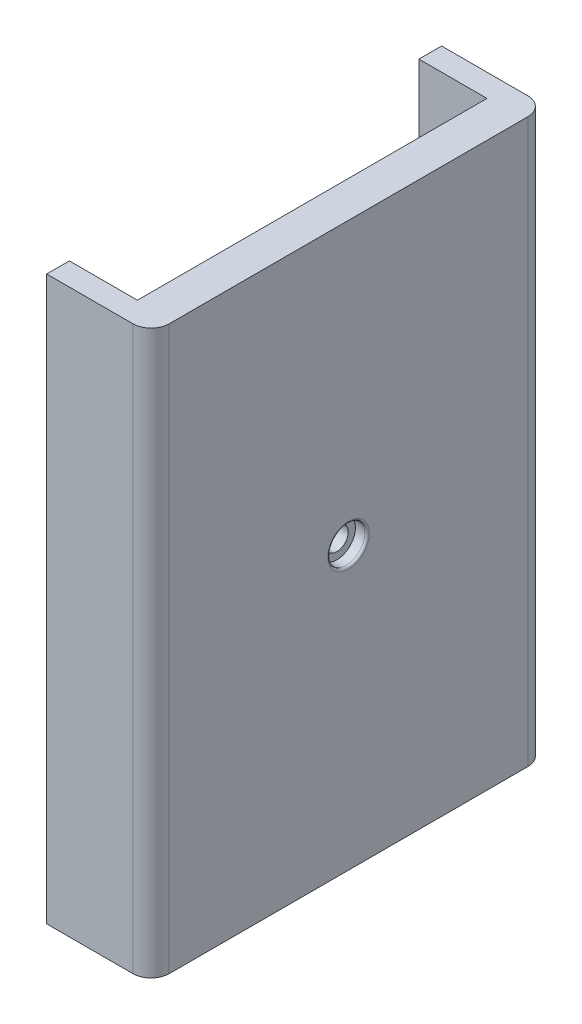
ISO-10303-21;
HEADER;
FILE_DESCRIPTION(('STEP AP214'),'2;1');
FILE_NAME('part.step','',(''),(''),'','','');
FILE_SCHEMA(('AUTOMOTIVE_DESIGN { 1 0 10303 214 1 1 1 1 }'));
ENDSEC;
DATA;
#1=APPLICATION_CONTEXT('core data for automotive mechanical design processes');
#2=APPLICATION_PROTOCOL_DEFINITION('international standard','automotive_design',2000,#1);
#3=PRODUCT_CONTEXT('',#1,'mechanical');
#4=PRODUCT('Part','Part','',(#3));
#5=PRODUCT_RELATED_PRODUCT_CATEGORY('part','',(#4));
#6=PRODUCT_DEFINITION_FORMATION('','',#4);
#7=PRODUCT_DEFINITION_CONTEXT('part definition',#1,'design');
#8=PRODUCT_DEFINITION('design','',#6,#7);
#9=PRODUCT_DEFINITION_SHAPE('','',#8);
#10=(LENGTH_UNIT() NAMED_UNIT(*) SI_UNIT(.MILLI.,.METRE.));
#11=(NAMED_UNIT(*) PLANE_ANGLE_UNIT() SI_UNIT($,.RADIAN.));
#12=(NAMED_UNIT(*) SI_UNIT($,.STERADIAN.) SOLID_ANGLE_UNIT());
#13=UNCERTAINTY_MEASURE_WITH_UNIT(LENGTH_MEASURE(1.E-05),#10,'distance_accuracy_value','');
#14=(GEOMETRIC_REPRESENTATION_CONTEXT(3) GLOBAL_UNCERTAINTY_ASSIGNED_CONTEXT((#13)) GLOBAL_UNIT_ASSIGNED_CONTEXT((#10,
#11,#12)) REPRESENTATION_CONTEXT('',''));
#15=CARTESIAN_POINT('',(0.,0.,0.));
#16=DIRECTION('',(0.,0.,1.));
#17=DIRECTION('',(1.,0.,0.));
#18=AXIS2_PLACEMENT_3D('',#15,#16,#17);
#19=CARTESIAN_POINT('',(20.255,0.,0.));
#20=DIRECTION('',(1.,0.,0.));
#21=DIRECTION('',(0.,1.,0.));
#22=AXIS2_PLACEMENT_3D('',#19,#20,#21);
#23=PLANE('',#22);
#24=CARTESIAN_POINT('',(20.255,0.,0.));
#25=DIRECTION('',(-1.,0.,0.));
#26=DIRECTION('',(0.,-1.,0.));
#27=AXIS2_PLACEMENT_3D('',#24,#25,#26);
#28=CIRCLE('',#27,18.25);
#29=CARTESIAN_POINT('',(20.255,-18.25,0.));
#30=VERTEX_POINT('',#29);
#31=EDGE_CURVE('E255',#30,#30,#28,.T.);
#32=ORIENTED_EDGE('',*,*,#31,.F.);
#33=EDGE_LOOP('',(#32));
#34=FACE_BOUND('',#33,.T.);
#35=DIRECTION('',(0.,-1.,0.));
#36=VECTOR('',#35,1.);
#37=CARTESIAN_POINT('',(20.255,62.,38.5));
#38=LINE('',#37,#36);
#39=CARTESIAN_POINT('',(20.255,62.,38.5));
#40=VERTEX_POINT('',#39);
#41=CARTESIAN_POINT('',(20.255,-62.,38.5));
#42=VERTEX_POINT('',#41);
#43=EDGE_CURVE('E153',#40,#42,#38,.T.);
#44=ORIENTED_EDGE('',*,*,#43,.F.);
#45=DIRECTION('',(0.,0.,1.));
#46=VECTOR('',#45,1.);
#47=CARTESIAN_POINT('',(20.255,62.,0.));
#48=LINE('',#47,#46);
#49=CARTESIAN_POINT('',(20.255,62.,-38.5));
#50=VERTEX_POINT('',#49);
#51=EDGE_CURVE('E204',#50,#40,#48,.T.);
#52=ORIENTED_EDGE('',*,*,#51,.F.);
#53=DIRECTION('',(0.,1.,0.));
#54=VECTOR('',#53,1.);
#55=CARTESIAN_POINT('',(20.255,62.,-38.5));
#56=LINE('',#55,#54);
#57=CARTESIAN_POINT('',(20.255,-62.,-38.5));
#58=VERTEX_POINT('',#57);
#59=EDGE_CURVE('E168',#58,#50,#56,.T.);
#60=ORIENTED_EDGE('',*,*,#59,.F.);
#61=DIRECTION('',(0.,0.,1.));
#62=VECTOR('',#61,1.);
#63=CARTESIAN_POINT('',(20.255,-62.,0.));
#64=LINE('',#63,#62);
#65=EDGE_CURVE('E199',#58,#42,#64,.T.);
#66=ORIENTED_EDGE('',*,*,#65,.T.);
#67=EDGE_LOOP('',(#44,#52,#60,#66));
#68=FACE_BOUND('',#67,.T.);
#69=ADVANCED_FACE('F45',(#34,#68),#23,.F.);
#70=CARTESIAN_POINT('',(8.25500000000001,0.,0.));
#71=DIRECTION('',(1.,0.,0.));
#72=DIRECTION('',(0.,1.,0.));
#73=AXIS2_PLACEMENT_3D('',#70,#71,#72);
#74=PLANE('',#73);
#75=CARTESIAN_POINT('',(8.25500000000001,0.,0.));
#76=DIRECTION('',(-1.,0.,0.));
#77=DIRECTION('',(0.,-1.,0.));
#78=AXIS2_PLACEMENT_3D('',#75,#76,#77);
#79=CIRCLE('',#78,13.15);
#80=CARTESIAN_POINT('',(8.25500000000001,-13.15,0.));
#81=VERTEX_POINT('',#80);
#82=EDGE_CURVE('E259',#81,#81,#79,.T.);
#83=ORIENTED_EDGE('',*,*,#82,.F.);
#84=EDGE_LOOP('',(#83));
#85=FACE_BOUND('',#84,.T.);
#86=CARTESIAN_POINT('',(8.25500000000001,0.,0.));
#87=DIRECTION('',(-1.,0.,0.));
#88=DIRECTION('',(0.,-1.,0.));
#89=AXIS2_PLACEMENT_3D('',#86,#87,#88);
#90=CIRCLE('',#89,18.25);
#91=CARTESIAN_POINT('',(8.25500000000002,-18.25,0.));
#92=VERTEX_POINT('',#91);
#93=EDGE_CURVE('E11',#92,#92,#90,.T.);
#94=ORIENTED_EDGE('',*,*,#93,.T.);
#95=EDGE_LOOP('',(#94));
#96=FACE_BOUND('',#95,.T.);
#97=ADVANCED_FACE('F47',(#85,#96),#74,.F.);
#98=CARTESIAN_POINT('',(8.255,0.,0.));
#99=DIRECTION('',(-1.,0.,0.));
#100=DIRECTION('',(0.,-1.,0.));
#101=AXIS2_PLACEMENT_3D('',#98,#99,#100);
#102=CYLINDRICAL_SURFACE('',#101,18.25);
#103=ORIENTED_EDGE('',*,*,#93,.F.);
#104=EDGE_LOOP('',(#103));
#105=FACE_BOUND('',#104,.T.);
#106=ORIENTED_EDGE('',*,*,#31,.T.);
#107=EDGE_LOOP('',(#106));
#108=FACE_BOUND('',#107,.T.);
#109=ADVANCED_FACE('F266',(#105,#108),#102,.T.);
#110=CARTESIAN_POINT('',(20.255,0.,0.));
#111=DIRECTION('',(-1.,0.,0.));
#112=DIRECTION('',(0.,-1.,0.));
#113=AXIS2_PLACEMENT_3D('',#110,#111,#112);
#114=CYLINDRICAL_SURFACE('',#113,13.15);
#115=CARTESIAN_POINT('',(20.255,0.,0.));
#116=DIRECTION('',(-1.,0.,0.));
#117=DIRECTION('',(0.,-1.,0.));
#118=AXIS2_PLACEMENT_3D('',#115,#116,#117);
#119=CIRCLE('',#118,13.15);
#120=CARTESIAN_POINT('',(20.255,-13.15,0.));
#121=VERTEX_POINT('',#120);
#122=EDGE_CURVE('E54',#121,#121,#119,.T.);
#123=ORIENTED_EDGE('',*,*,#122,.F.);
#124=EDGE_LOOP('',(#123));
#125=FACE_BOUND('',#124,.T.);
#126=ORIENTED_EDGE('',*,*,#82,.T.);
#127=EDGE_LOOP('',(#126));
#128=FACE_BOUND('',#127,.T.);
#129=ADVANCED_FACE('F341',(#125,#128),#114,.F.);
#130=CARTESIAN_POINT('',(20.255,0.,0.));
#131=DIRECTION('',(1.,0.,0.));
#132=DIRECTION('',(0.,1.,0.));
#133=AXIS2_PLACEMENT_3D('',#130,#131,#132);
#134=CIRCLE('',#133,2.5);
#135=CARTESIAN_POINT('',(20.255,2.50000000000001,0.));
#136=VERTEX_POINT('',#135);
#137=EDGE_CURVE('E190',#136,#136,#134,.F.);
#138=ORIENTED_EDGE('',*,*,#137,.F.);
#139=EDGE_LOOP('',(#138));
#140=FACE_BOUND('',#139,.T.);
#141=ORIENTED_EDGE('',*,*,#122,.T.);
#142=EDGE_LOOP('',(#141));
#143=FACE_BOUND('',#142,.T.);
#144=ADVANCED_FACE('F271',(#140,#143),#23,.F.);
#145=CARTESIAN_POINT('',(28.255,0.,43.5));
#146=DIRECTION('',(0.,0.,1.));
#147=DIRECTION('',(1.,0.,0.));
#148=AXIS2_PLACEMENT_3D('',#145,#146,#147);
#149=PLANE('',#148);
#150=DIRECTION('',(-1.,0.,0.));
#151=VECTOR('',#150,1.);
#152=CARTESIAN_POINT('',(28.255,-62.,43.5));
#153=LINE('',#152,#151);
#154=CARTESIAN_POINT('',(24.255,-62.,43.5));
#155=VERTEX_POINT('',#154);
#156=CARTESIAN_POINT('',(5.25500000000005,-62.,43.5));
#157=VERTEX_POINT('',#156);
#158=EDGE_CURVE('E218',#155,#157,#153,.T.);
#159=ORIENTED_EDGE('',*,*,#158,.F.);
#160=DIRECTION('',(0.,1.,0.));
#161=VECTOR('',#160,1.);
#162=CARTESIAN_POINT('',(24.255,0.,43.5));
#163=LINE('',#162,#161);
#164=CARTESIAN_POINT('',(24.255,62.,43.5));
#165=VERTEX_POINT('',#164);
#166=EDGE_CURVE('E134',#155,#165,#163,.T.);
#167=ORIENTED_EDGE('',*,*,#166,.T.);
#168=DIRECTION('',(-1.,0.,0.));
#169=VECTOR('',#168,1.);
#170=CARTESIAN_POINT('',(28.255,62.,43.5));
#171=LINE('',#170,#169);
#172=CARTESIAN_POINT('',(5.25499999999996,62.,43.5));
#173=VERTEX_POINT('',#172);
#174=EDGE_CURVE('E127',#165,#173,#171,.T.);
#175=ORIENTED_EDGE('',*,*,#174,.T.);
#176=DIRECTION('',(0.,1.,0.));
#177=VECTOR('',#176,1.);
#178=CARTESIAN_POINT('',(5.25499999999996,62.,43.5));
#179=LINE('',#178,#177);
#180=EDGE_CURVE('E132',#157,#173,#179,.T.);
#181=ORIENTED_EDGE('',*,*,#180,.F.);
#182=EDGE_LOOP('',(#159,#167,#175,#181));
#183=FACE_BOUND('',#182,.T.);
#184=ADVANCED_FACE('F130',(#183),#149,.T.);
#185=CARTESIAN_POINT('',(28.255,-62.,0.));
#186=DIRECTION('',(0.,-1.,0.));
#187=DIRECTION('',(1.,0.,0.));
#188=AXIS2_PLACEMENT_3D('',#185,#186,#187);
#189=PLANE('',#188);
#190=DIRECTION('',(0.,0.,1.));
#191=VECTOR('',#190,1.);
#192=CARTESIAN_POINT('',(28.255,-62.,0.));
#193=LINE('',#192,#191);
#194=CARTESIAN_POINT('',(28.255,-62.,-39.5));
#195=VERTEX_POINT('',#194);
#196=CARTESIAN_POINT('',(28.255,-62.,39.5));
#197=VERTEX_POINT('',#196);
#198=EDGE_CURVE('E200',#195,#197,#193,.T.);
#199=ORIENTED_EDGE('',*,*,#198,.T.);
#200=CARTESIAN_POINT('',(24.255,-62.,39.5));
#201=DIRECTION('',(0.,-1.,0.));
#202=DIRECTION('',(1.,0.,0.));
#203=AXIS2_PLACEMENT_3D('',#200,#201,#202);
#204=CIRCLE('',#203,4.);
#205=EDGE_CURVE('E239',#197,#155,#204,.T.);
#206=ORIENTED_EDGE('',*,*,#205,.T.);
#207=ORIENTED_EDGE('',*,*,#158,.T.);
#208=DIRECTION('',(0.,0.,1.));
#209=VECTOR('',#208,1.);
#210=CARTESIAN_POINT('',(5.25500000000005,-62.,43.5));
#211=LINE('',#210,#209);
#212=CARTESIAN_POINT('',(5.25500000000005,-62.,38.5));
#213=VERTEX_POINT('',#212);
#214=EDGE_CURVE('E151',#213,#157,#211,.T.);
#215=ORIENTED_EDGE('',*,*,#214,.F.);
#216=DIRECTION('',(1.,0.,0.));
#217=VECTOR('',#216,1.);
#218=CARTESIAN_POINT('',(5.25500000000005,-62.,38.5));
#219=LINE('',#218,#217);
#220=EDGE_CURVE('E161',#213,#42,#219,.T.);
#221=ORIENTED_EDGE('',*,*,#220,.T.);
#222=ORIENTED_EDGE('',*,*,#65,.F.);
#223=DIRECTION('',(1.,0.,0.));
#224=VECTOR('',#223,1.);
#225=CARTESIAN_POINT('',(5.25500000000005,-62.,-38.5));
#226=LINE('',#225,#224);
#227=CARTESIAN_POINT('',(5.25500000000005,-62.,-38.5));
#228=VERTEX_POINT('',#227);
#229=EDGE_CURVE('E187',#228,#58,#226,.T.);
#230=ORIENTED_EDGE('',*,*,#229,.F.);
#231=DIRECTION('',(0.,0.,1.));
#232=VECTOR('',#231,1.);
#233=CARTESIAN_POINT('',(5.25500000000005,-62.,-43.5));
#234=LINE('',#233,#232);
#235=CARTESIAN_POINT('',(5.25500000000005,-62.,-43.5));
#236=VERTEX_POINT('',#235);
#237=EDGE_CURVE('E173',#236,#228,#234,.T.);
#238=ORIENTED_EDGE('',*,*,#237,.F.);
#239=DIRECTION('',(-1.,0.,0.));
#240=VECTOR('',#239,1.);
#241=CARTESIAN_POINT('',(28.255,-62.,-43.5));
#242=LINE('',#241,#240);
#243=CARTESIAN_POINT('',(24.255,-62.,-43.5));
#244=VERTEX_POINT('',#243);
#245=EDGE_CURVE('E215',#244,#236,#242,.T.);
#246=ORIENTED_EDGE('',*,*,#245,.F.);
#247=CARTESIAN_POINT('',(24.255,-62.,-39.5));
#248=DIRECTION('',(0.,-1.,0.));
#249=DIRECTION('',(1.,0.,0.));
#250=AXIS2_PLACEMENT_3D('',#247,#248,#249);
#251=CIRCLE('',#250,4.);
#252=EDGE_CURVE('E236',#244,#195,#251,.T.);
#253=ORIENTED_EDGE('',*,*,#252,.T.);
#254=EDGE_LOOP('',(#199,#206,#207,#215,#221,#222,#230,#238,#246,#253));
#255=FACE_BOUND('',#254,.T.);
#256=ADVANCED_FACE('F280',(#255),#189,.T.);
#257=CARTESIAN_POINT('',(28.255,0.,-43.5));
#258=DIRECTION('',(0.,0.,1.));
#259=DIRECTION('',(1.,0.,0.));
#260=AXIS2_PLACEMENT_3D('',#257,#258,#259);
#261=PLANE('',#260);
#262=DIRECTION('',(-1.,0.,0.));
#263=VECTOR('',#262,1.);
#264=CARTESIAN_POINT('',(28.255,62.,-43.5));
#265=LINE('',#264,#263);
#266=CARTESIAN_POINT('',(24.255,62.,-43.5));
#267=VERTEX_POINT('',#266);
#268=CARTESIAN_POINT('',(5.25499999999996,62.,-43.5));
#269=VERTEX_POINT('',#268);
#270=EDGE_CURVE('E136',#267,#269,#265,.T.);
#271=ORIENTED_EDGE('',*,*,#270,.F.);
#272=DIRECTION('',(0.,1.,0.));
#273=VECTOR('',#272,1.);
#274=CARTESIAN_POINT('',(24.255,-62.,-43.5));
#275=LINE('',#274,#273);
#276=EDGE_CURVE('E69',#267,#244,#275,.F.);
#277=ORIENTED_EDGE('',*,*,#276,.T.);
#278=ORIENTED_EDGE('',*,*,#245,.T.);
#279=DIRECTION('',(0.,-1.,0.));
#280=VECTOR('',#279,1.);
#281=CARTESIAN_POINT('',(5.25499999999996,62.,-43.5));
#282=LINE('',#281,#280);
#283=EDGE_CURVE('E169',#269,#236,#282,.T.);
#284=ORIENTED_EDGE('',*,*,#283,.F.);
#285=EDGE_LOOP('',(#271,#277,#278,#284));
#286=FACE_BOUND('',#285,.T.);
#287=ADVANCED_FACE('F295',(#286),#261,.F.);
#288=CARTESIAN_POINT('',(28.255,62.,0.));
#289=DIRECTION('',(0.,-1.,0.));
#290=DIRECTION('',(1.,0.,0.));
#291=AXIS2_PLACEMENT_3D('',#288,#289,#290);
#292=PLANE('',#291);
#293=ORIENTED_EDGE('',*,*,#174,.F.);
#294=CARTESIAN_POINT('',(24.255,62.,39.5));
#295=DIRECTION('',(0.,-1.,0.));
#296=DIRECTION('',(1.,0.,0.));
#297=AXIS2_PLACEMENT_3D('',#294,#295,#296);
#298=CIRCLE('',#297,4.);
#299=CARTESIAN_POINT('',(28.255,62.,39.5));
#300=VERTEX_POINT('',#299);
#301=EDGE_CURVE('E226',#165,#300,#298,.F.);
#302=ORIENTED_EDGE('',*,*,#301,.T.);
#303=DIRECTION('',(0.,0.,1.));
#304=VECTOR('',#303,1.);
#305=CARTESIAN_POINT('',(28.255,62.,0.));
#306=LINE('',#305,#304);
#307=CARTESIAN_POINT('',(28.255,62.,-39.5));
#308=VERTEX_POINT('',#307);
#309=EDGE_CURVE('E137',#308,#300,#306,.T.);
#310=ORIENTED_EDGE('',*,*,#309,.F.);
#311=CARTESIAN_POINT('',(24.255,62.,-39.5));
#312=DIRECTION('',(0.,-1.,0.));
#313=DIRECTION('',(1.,0.,0.));
#314=AXIS2_PLACEMENT_3D('',#311,#312,#313);
#315=CIRCLE('',#314,4.);
#316=EDGE_CURVE('E223',#308,#267,#315,.F.);
#317=ORIENTED_EDGE('',*,*,#316,.T.);
#318=ORIENTED_EDGE('',*,*,#270,.T.);
#319=DIRECTION('',(0.,0.,-1.));
#320=VECTOR('',#319,1.);
#321=CARTESIAN_POINT('',(5.25499999999996,62.,-43.5));
#322=LINE('',#321,#320);
#323=CARTESIAN_POINT('',(5.25499999999996,62.,-38.5));
#324=VERTEX_POINT('',#323);
#325=EDGE_CURVE('E179',#324,#269,#322,.T.);
#326=ORIENTED_EDGE('',*,*,#325,.F.);
#327=DIRECTION('',(1.,0.,0.));
#328=VECTOR('',#327,1.);
#329=CARTESIAN_POINT('',(5.25499999999996,62.,-38.5));
#330=LINE('',#329,#328);
#331=EDGE_CURVE('E61',#324,#50,#330,.T.);
#332=ORIENTED_EDGE('',*,*,#331,.T.);
#333=ORIENTED_EDGE('',*,*,#51,.T.);
#334=DIRECTION('',(1.,0.,0.));
#335=VECTOR('',#334,1.);
#336=CARTESIAN_POINT('',(5.25499999999996,62.,38.5));
#337=LINE('',#336,#335);
#338=CARTESIAN_POINT('',(5.25499999999996,62.,38.5));
#339=VERTEX_POINT('',#338);
#340=EDGE_CURVE('E142',#339,#40,#337,.T.);
#341=ORIENTED_EDGE('',*,*,#340,.F.);
#342=DIRECTION('',(0.,0.,-1.));
#343=VECTOR('',#342,1.);
#344=CARTESIAN_POINT('',(5.25499999999996,62.,43.5));
#345=LINE('',#344,#343);
#346=EDGE_CURVE('E140',#173,#339,#345,.T.);
#347=ORIENTED_EDGE('',*,*,#346,.F.);
#348=EDGE_LOOP('',(#293,#302,#310,#317,#318,#326,#332,#333,#341,#347));
#349=FACE_BOUND('',#348,.T.);
#350=ADVANCED_FACE('F141',(#349),#292,.F.);
#351=CARTESIAN_POINT('',(28.255,0.,0.));
#352=DIRECTION('',(1.,0.,0.));
#353=DIRECTION('',(0.,1.,0.));
#354=AXIS2_PLACEMENT_3D('',#351,#352,#353);
#355=PLANE('',#354);
#356=CARTESIAN_POINT('',(28.255,0.,0.));
#357=DIRECTION('',(1.,0.,0.));
#358=DIRECTION('',(0.,1.,0.));
#359=AXIS2_PLACEMENT_3D('',#356,#357,#358);
#360=CIRCLE('',#359,4.575);
#361=CARTESIAN_POINT('',(28.255,4.57500000000002,0.));
#362=VERTEX_POINT('',#361);
#363=EDGE_CURVE('E251',#362,#362,#360,.F.);
#364=ORIENTED_EDGE('',*,*,#363,.T.);
#365=EDGE_LOOP('',(#364));
#366=FACE_BOUND('',#365,.T.);
#367=ORIENTED_EDGE('',*,*,#309,.T.);
#368=DIRECTION('',(0.,1.,0.));
#369=VECTOR('',#368,1.);
#370=CARTESIAN_POINT('',(28.255,0.,39.5));
#371=LINE('',#370,#369);
#372=EDGE_CURVE('E233',#300,#197,#371,.F.);
#373=ORIENTED_EDGE('',*,*,#372,.T.);
#374=ORIENTED_EDGE('',*,*,#198,.F.);
#375=DIRECTION('',(0.,1.,0.));
#376=VECTOR('',#375,1.);
#377=CARTESIAN_POINT('',(28.255,62.,-39.5));
#378=LINE('',#377,#376);
#379=EDGE_CURVE('E229',#195,#308,#378,.T.);
#380=ORIENTED_EDGE('',*,*,#379,.T.);
#381=EDGE_LOOP('',(#367,#373,#374,#380));
#382=FACE_BOUND('',#381,.T.);
#383=ADVANCED_FACE('F288',(#366,#382),#355,.T.);
#384=CARTESIAN_POINT('',(24.255,0.,39.5));
#385=DIRECTION('',(0.,1.,0.));
#386=DIRECTION('',(-1.,0.,0.));
#387=AXIS2_PLACEMENT_3D('',#384,#385,#386);
#388=CYLINDRICAL_SURFACE('',#387,4.);
#389=ORIENTED_EDGE('',*,*,#205,.F.);
#390=ORIENTED_EDGE('',*,*,#372,.F.);
#391=ORIENTED_EDGE('',*,*,#301,.F.);
#392=ORIENTED_EDGE('',*,*,#166,.F.);
#393=EDGE_LOOP('',(#389,#390,#391,#392));
#394=FACE_BOUND('',#393,.T.);
#395=ADVANCED_FACE('F284',(#394),#388,.T.);
#396=CARTESIAN_POINT('',(24.255,0.,-39.5));
#397=DIRECTION('',(0.,-1.,0.));
#398=DIRECTION('',(1.,0.,0.));
#399=AXIS2_PLACEMENT_3D('',#396,#397,#398);
#400=CYLINDRICAL_SURFACE('',#399,4.);
#401=ORIENTED_EDGE('',*,*,#252,.F.);
#402=ORIENTED_EDGE('',*,*,#276,.F.);
#403=ORIENTED_EDGE('',*,*,#316,.F.);
#404=ORIENTED_EDGE('',*,*,#379,.F.);
#405=EDGE_LOOP('',(#401,#402,#403,#404));
#406=FACE_BOUND('',#405,.T.);
#407=ADVANCED_FACE('F293',(#406),#400,.T.);
#408=CARTESIAN_POINT('',(25.695,0.,0.));
#409=DIRECTION('',(1.,0.,0.));
#410=DIRECTION('',(0.,1.,0.));
#411=AXIS2_PLACEMENT_3D('',#408,#409,#410);
#412=CYLINDRICAL_SURFACE('',#411,4.075);
#413=CARTESIAN_POINT('',(27.755,0.,0.));
#414=DIRECTION('',(1.,0.,0.));
#415=DIRECTION('',(0.,1.,0.));
#416=AXIS2_PLACEMENT_3D('',#413,#414,#415);
#417=CIRCLE('',#416,4.075);
#418=CARTESIAN_POINT('',(27.755,4.07500000000002,0.));
#419=VERTEX_POINT('',#418);
#420=EDGE_CURVE('E244',#419,#419,#417,.T.);
#421=ORIENTED_EDGE('',*,*,#420,.T.);
#422=EDGE_LOOP('',(#421));
#423=FACE_BOUND('',#422,.T.);
#424=CARTESIAN_POINT('',(25.695,0.,0.));
#425=DIRECTION('',(1.,0.,0.));
#426=DIRECTION('',(0.,1.,0.));
#427=AXIS2_PLACEMENT_3D('',#424,#425,#426);
#428=CIRCLE('',#427,4.075);
#429=CARTESIAN_POINT('',(25.695,4.07500000000002,0.));
#430=VERTEX_POINT('',#429);
#431=EDGE_CURVE('E195',#430,#430,#428,.T.);
#432=ORIENTED_EDGE('',*,*,#431,.F.);
#433=EDGE_LOOP('',(#432));
#434=FACE_BOUND('',#433,.T.);
#435=ADVANCED_FACE('F322',(#423,#434),#412,.F.);
#436=CARTESIAN_POINT('',(25.695,0.,0.));
#437=DIRECTION('',(1.,0.,0.));
#438=DIRECTION('',(0.,1.,0.));
#439=AXIS2_PLACEMENT_3D('',#436,#437,#438);
#440=PLANE('',#439);
#441=CARTESIAN_POINT('',(25.695,0.,0.));
#442=DIRECTION('',(1.,0.,0.));
#443=DIRECTION('',(0.,1.,0.));
#444=AXIS2_PLACEMENT_3D('',#441,#442,#443);
#445=CIRCLE('',#444,2.5);
#446=CARTESIAN_POINT('',(25.695,2.50000000000002,0.));
#447=VERTEX_POINT('',#446);
#448=EDGE_CURVE('E194',#447,#447,#445,.T.);
#449=ORIENTED_EDGE('',*,*,#448,.F.);
#450=EDGE_LOOP('',(#449));
#451=FACE_BOUND('',#450,.T.);
#452=ORIENTED_EDGE('',*,*,#431,.T.);
#453=EDGE_LOOP('',(#452));
#454=FACE_BOUND('',#453,.T.);
#455=ADVANCED_FACE('F318',(#451,#454),#440,.T.);
#456=CARTESIAN_POINT('',(13.1839321881345,0.,0.));
#457=DIRECTION('',(1.,0.,0.));
#458=DIRECTION('',(0.,1.,0.));
#459=AXIS2_PLACEMENT_3D('',#456,#457,#458);
#460=CYLINDRICAL_SURFACE('',#459,2.5);
#461=ORIENTED_EDGE('',*,*,#448,.T.);
#462=EDGE_LOOP('',(#461));
#463=FACE_BOUND('',#462,.T.);
#464=ORIENTED_EDGE('',*,*,#137,.T.);
#465=EDGE_LOOP('',(#464));
#466=FACE_BOUND('',#465,.T.);
#467=ADVANCED_FACE('F311',(#463,#466),#460,.F.);
#468=CARTESIAN_POINT('',(27.755,0.,0.));
#469=DIRECTION('',(1.,0.,0.));
#470=DIRECTION('',(0.,1.,0.));
#471=AXIS2_PLACEMENT_3D('',#468,#469,#470);
#472=TOROIDAL_SURFACE('',#471,4.575,0.5);
#473=ORIENTED_EDGE('',*,*,#363,.F.);
#474=EDGE_LOOP('',(#473));
#475=FACE_BOUND('',#474,.T.);
#476=ORIENTED_EDGE('',*,*,#420,.F.);
#477=EDGE_LOOP('',(#476));
#478=FACE_BOUND('',#477,.T.);
#479=ADVANCED_FACE('F303',(#475,#478),#472,.T.);
#480=CARTESIAN_POINT('',(5.25499999999996,62.,-38.5));
#481=DIRECTION('',(0.,0.,-1.));
#482=DIRECTION('',(0.,1.,0.));
#483=AXIS2_PLACEMENT_3D('',#480,#481,#482);
#484=PLANE('',#483);
#485=ORIENTED_EDGE('',*,*,#59,.T.);
#486=ORIENTED_EDGE('',*,*,#331,.F.);
#487=DIRECTION('',(0.,1.,0.));
#488=VECTOR('',#487,1.);
#489=CARTESIAN_POINT('',(5.25499999999996,62.,-38.5));
#490=LINE('',#489,#488);
#491=EDGE_CURVE('E176',#228,#324,#490,.T.);
#492=ORIENTED_EDGE('',*,*,#491,.F.);
#493=ORIENTED_EDGE('',*,*,#229,.T.);
#494=EDGE_LOOP('',(#485,#486,#492,#493));
#495=FACE_BOUND('',#494,.T.);
#496=ADVANCED_FACE('F301',(#495),#484,.F.);
#497=CARTESIAN_POINT('',(5.25500000000001,0.,0.));
#498=DIRECTION('',(-1.,0.,0.));
#499=DIRECTION('',(0.,-1.,0.));
#500=AXIS2_PLACEMENT_3D('',#497,#498,#499);
#501=PLANE('',#500);
#502=ORIENTED_EDGE('',*,*,#283,.T.);
#503=ORIENTED_EDGE('',*,*,#237,.T.);
#504=ORIENTED_EDGE('',*,*,#491,.T.);
#505=ORIENTED_EDGE('',*,*,#325,.T.);
#506=EDGE_LOOP('',(#502,#503,#504,#505));
#507=FACE_BOUND('',#506,.T.);
#508=ADVANCED_FACE('F298',(#507),#501,.T.);
#509=CARTESIAN_POINT('',(5.25499999999996,62.,38.5));
#510=DIRECTION('',(0.,0.,1.));
#511=DIRECTION('',(0.,-1.,0.));
#512=AXIS2_PLACEMENT_3D('',#509,#510,#511);
#513=PLANE('',#512);
#514=ORIENTED_EDGE('',*,*,#43,.T.);
#515=ORIENTED_EDGE('',*,*,#220,.F.);
#516=DIRECTION('',(0.,-1.,0.));
#517=VECTOR('',#516,1.);
#518=CARTESIAN_POINT('',(5.25499999999996,62.,38.5));
#519=LINE('',#518,#517);
#520=EDGE_CURVE('E146',#339,#213,#519,.T.);
#521=ORIENTED_EDGE('',*,*,#520,.F.);
#522=ORIENTED_EDGE('',*,*,#340,.T.);
#523=EDGE_LOOP('',(#514,#515,#521,#522));
#524=FACE_BOUND('',#523,.T.);
#525=ADVANCED_FACE('F278',(#524),#513,.F.);
#526=CARTESIAN_POINT('',(5.25500000000001,0.,0.));
#527=DIRECTION('',(1.,0.,0.));
#528=DIRECTION('',(0.,1.,0.));
#529=AXIS2_PLACEMENT_3D('',#526,#527,#528);
#530=PLANE('',#529);
#531=ORIENTED_EDGE('',*,*,#180,.T.);
#532=ORIENTED_EDGE('',*,*,#346,.T.);
#533=ORIENTED_EDGE('',*,*,#520,.T.);
#534=ORIENTED_EDGE('',*,*,#214,.T.);
#535=EDGE_LOOP('',(#531,#532,#533,#534));
#536=FACE_BOUND('',#535,.T.);
#537=ADVANCED_FACE('F149',(#536),#530,.F.);
#538=CLOSED_SHELL('',(#69,#97,#109,#129,#144,#184,#256,#287,#350,#383,#395,#407,#435,#455,#467,
#479,#496,#508,#525,#537));
#539=MANIFOLD_SOLID_BREP('B2',#538);
#540=ADVANCED_BREP_SHAPE_REPRESENTATION('',(#18,#539),#14);
#541=SHAPE_DEFINITION_REPRESENTATION(#9,#540);
ENDSEC;
END-ISO-10303-21;
